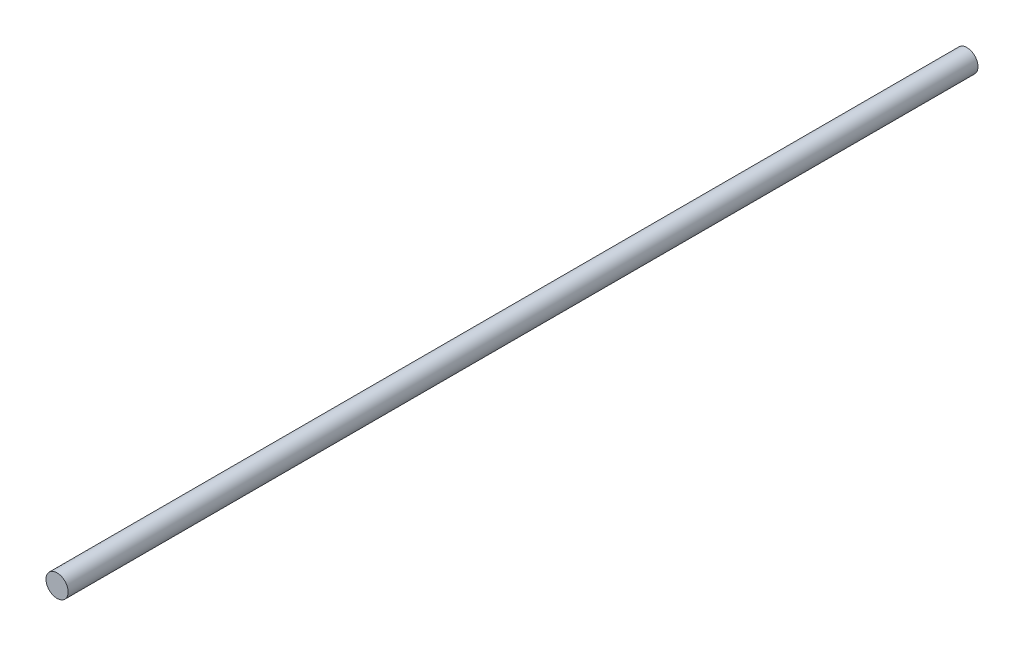
ISO-10303-21;
HEADER;
FILE_DESCRIPTION(('STEP AP214'),'2;1');
FILE_NAME('part.step','',(''),(''),'','','');
FILE_SCHEMA(('AUTOMOTIVE_DESIGN { 1 0 10303 214 1 1 1 1 }'));
ENDSEC;
DATA;
#1=APPLICATION_CONTEXT('core data for automotive mechanical design processes');
#2=APPLICATION_PROTOCOL_DEFINITION('international standard','automotive_design',2000,#1);
#3=PRODUCT_CONTEXT('',#1,'mechanical');
#4=PRODUCT('Part','Part','',(#3));
#5=PRODUCT_RELATED_PRODUCT_CATEGORY('part','',(#4));
#6=PRODUCT_DEFINITION_FORMATION('','',#4);
#7=PRODUCT_DEFINITION_CONTEXT('part definition',#1,'design');
#8=PRODUCT_DEFINITION('design','',#6,#7);
#9=PRODUCT_DEFINITION_SHAPE('','',#8);
#10=(LENGTH_UNIT() NAMED_UNIT(*) SI_UNIT(.MILLI.,.METRE.));
#11=(NAMED_UNIT(*) PLANE_ANGLE_UNIT() SI_UNIT($,.RADIAN.));
#12=(NAMED_UNIT(*) SI_UNIT($,.STERADIAN.) SOLID_ANGLE_UNIT());
#13=UNCERTAINTY_MEASURE_WITH_UNIT(LENGTH_MEASURE(1.E-05),#10,'distance_accuracy_value','');
#14=(GEOMETRIC_REPRESENTATION_CONTEXT(3) GLOBAL_UNCERTAINTY_ASSIGNED_CONTEXT((#13)) GLOBAL_UNIT_ASSIGNED_CONTEXT((#10,
#11,#12)) REPRESENTATION_CONTEXT('',''));
#15=CARTESIAN_POINT('',(0.,0.,0.));
#16=DIRECTION('',(0.,0.,1.));
#17=DIRECTION('',(1.,0.,0.));
#18=AXIS2_PLACEMENT_3D('',#15,#16,#17);
#19=CARTESIAN_POINT('',(0.,0.,205.));
#20=DIRECTION('',(0.,0.,-1.));
#21=DIRECTION('',(-1.,0.,0.));
#22=AXIS2_PLACEMENT_3D('',#19,#20,#21);
#23=CYLINDRICAL_SURFACE('',#22,5.);
#24=CARTESIAN_POINT('',(0.,0.,205.));
#25=DIRECTION('',(0.,0.,1.));
#26=DIRECTION('',(1.,0.,0.));
#27=AXIS2_PLACEMENT_3D('',#24,#25,#26);
#28=CIRCLE('',#27,5.);
#29=CARTESIAN_POINT('',(5.,0.,205.));
#30=VERTEX_POINT('',#29);
#31=EDGE_CURVE('E10',#30,#30,#28,.T.);
#32=ORIENTED_EDGE('',*,*,#31,.F.);
#33=EDGE_LOOP('',(#32));
#34=FACE_BOUND('',#33,.T.);
#35=CARTESIAN_POINT('',(0.,0.,-205.));
#36=DIRECTION('',(0.,0.,1.));
#37=DIRECTION('',(1.,0.,0.));
#38=AXIS2_PLACEMENT_3D('',#35,#36,#37);
#39=CIRCLE('',#38,5.);
#40=CARTESIAN_POINT('',(5.,0.,-205.));
#41=VERTEX_POINT('',#40);
#42=EDGE_CURVE('E34',#41,#41,#39,.T.);
#43=ORIENTED_EDGE('',*,*,#42,.T.);
#44=EDGE_LOOP('',(#43));
#45=FACE_BOUND('',#44,.T.);
#46=ADVANCED_FACE('F31',(#34,#45),#23,.T.);
#47=CARTESIAN_POINT('',(0.,0.,205.));
#48=DIRECTION('',(0.,0.,1.));
#49=DIRECTION('',(1.,0.,0.));
#50=AXIS2_PLACEMENT_3D('',#47,#48,#49);
#51=PLANE('',#50);
#52=ORIENTED_EDGE('',*,*,#31,.T.);
#53=EDGE_LOOP('',(#52));
#54=FACE_BOUND('',#53,.T.);
#55=ADVANCED_FACE('F46',(#54),#51,.T.);
#56=CARTESIAN_POINT('',(0.,0.,-205.));
#57=DIRECTION('',(0.,0.,1.));
#58=DIRECTION('',(1.,0.,0.));
#59=AXIS2_PLACEMENT_3D('',#56,#57,#58);
#60=PLANE('',#59);
#61=ORIENTED_EDGE('',*,*,#42,.F.);
#62=EDGE_LOOP('',(#61));
#63=FACE_BOUND('',#62,.T.);
#64=ADVANCED_FACE('F44',(#63),#60,.F.);
#65=CLOSED_SHELL('',(#46,#55,#64));
#66=MANIFOLD_SOLID_BREP('B2',#65);
#67=ADVANCED_BREP_SHAPE_REPRESENTATION('',(#18,#66),#14);
#68=SHAPE_DEFINITION_REPRESENTATION(#9,#67);
ENDSEC;
END-ISO-10303-21;
